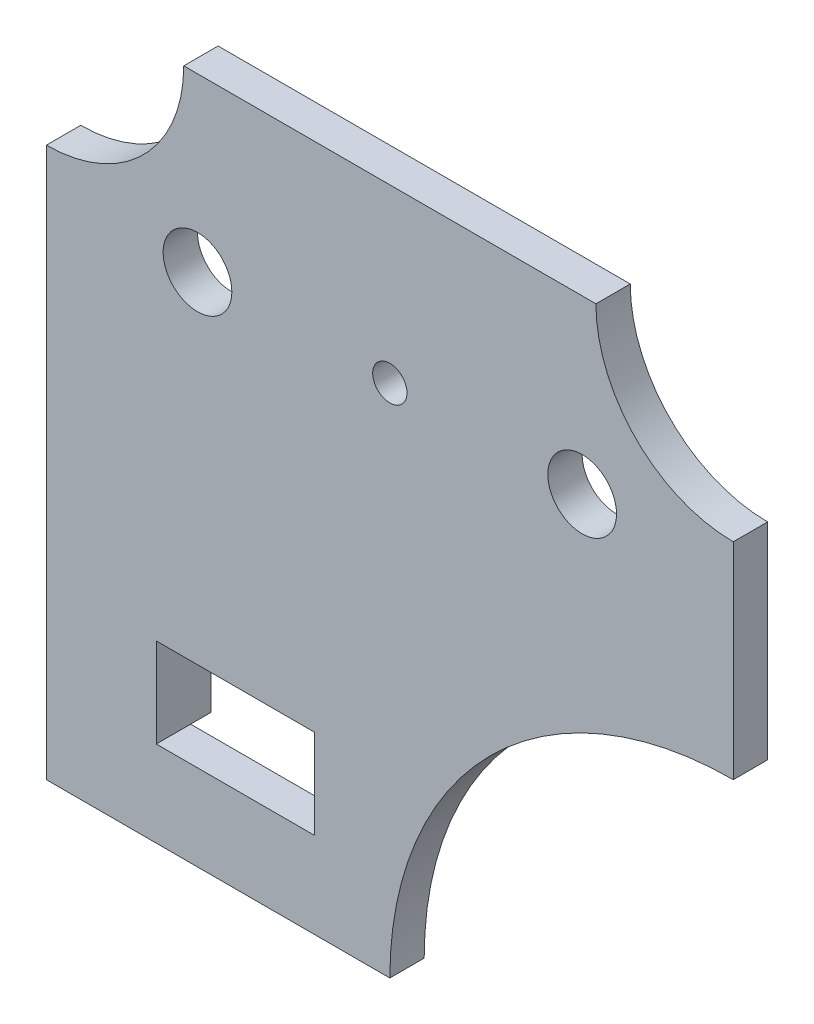
ISO-10303-21;
HEADER;
FILE_DESCRIPTION(('STEP AP214'),'2;1');
FILE_NAME('part.step','',(''),(''),'','','');
FILE_SCHEMA(('AUTOMOTIVE_DESIGN { 1 0 10303 214 1 1 1 1 }'));
ENDSEC;
DATA;
#1=APPLICATION_CONTEXT('core data for automotive mechanical design processes');
#2=APPLICATION_PROTOCOL_DEFINITION('international standard','automotive_design',2000,#1);
#3=PRODUCT_CONTEXT('',#1,'mechanical');
#4=PRODUCT('Part','Part','',(#3));
#5=PRODUCT_RELATED_PRODUCT_CATEGORY('part','',(#4));
#6=PRODUCT_DEFINITION_FORMATION('','',#4);
#7=PRODUCT_DEFINITION_CONTEXT('part definition',#1,'design');
#8=PRODUCT_DEFINITION('design','',#6,#7);
#9=PRODUCT_DEFINITION_SHAPE('','',#8);
#10=(LENGTH_UNIT() NAMED_UNIT(*) SI_UNIT(.MILLI.,.METRE.));
#11=(NAMED_UNIT(*) PLANE_ANGLE_UNIT() SI_UNIT($,.RADIAN.));
#12=(NAMED_UNIT(*) SI_UNIT($,.STERADIAN.) SOLID_ANGLE_UNIT());
#13=UNCERTAINTY_MEASURE_WITH_UNIT(LENGTH_MEASURE(1.E-05),#10,'distance_accuracy_value','');
#14=(GEOMETRIC_REPRESENTATION_CONTEXT(3) GLOBAL_UNCERTAINTY_ASSIGNED_CONTEXT((#13)) GLOBAL_UNIT_ASSIGNED_CONTEXT((#10,
#11,#12)) REPRESENTATION_CONTEXT('',''));
#15=CARTESIAN_POINT('',(0.,0.,0.));
#16=DIRECTION('',(0.,0.,1.));
#17=DIRECTION('',(1.,0.,0.));
#18=AXIS2_PLACEMENT_3D('',#15,#16,#17);
#19=CARTESIAN_POINT('',(50.,-75.,-2.5));
#20=DIRECTION('',(0.,0.,1.));
#21=DIRECTION('',(1.,0.,0.));
#22=AXIS2_PLACEMENT_3D('',#19,#20,#21);
#23=PLANE('',#22);
#24=DIRECTION('',(0.,-1.,0.));
#25=VECTOR('',#24,1.);
#26=CARTESIAN_POINT('',(-50.,5.,-2.5));
#27=LINE('',#26,#25);
#28=CARTESIAN_POINT('',(-50.,5.,-2.5));
#29=VERTEX_POINT('',#28);
#30=CARTESIAN_POINT('',(-50.,-75.,-2.5));
#31=VERTEX_POINT('',#30);
#32=EDGE_CURVE('E298',#29,#31,#27,.T.);
#33=ORIENTED_EDGE('',*,*,#32,.F.);
#34=CARTESIAN_POINT('',(-50.,25.,-2.5));
#35=DIRECTION('',(0.,0.,-1.));
#36=DIRECTION('',(1.,0.,0.));
#37=AXIS2_PLACEMENT_3D('',#34,#35,#36);
#38=CIRCLE('',#37,20.);
#39=CARTESIAN_POINT('',(-30.,25.,-2.5));
#40=VERTEX_POINT('',#39);
#41=EDGE_CURVE('E307',#40,#29,#38,.T.);
#42=ORIENTED_EDGE('',*,*,#41,.F.);
#43=DIRECTION('',(-1.,0.,0.));
#44=VECTOR('',#43,1.);
#45=CARTESIAN_POINT('',(30.,25.,-2.5));
#46=LINE('',#45,#44);
#47=CARTESIAN_POINT('',(30.,25.,-2.5));
#48=VERTEX_POINT('',#47);
#49=EDGE_CURVE('E341',#48,#40,#46,.T.);
#50=ORIENTED_EDGE('',*,*,#49,.F.);
#51=CARTESIAN_POINT('',(50.,25.,-2.5));
#52=DIRECTION('',(0.,0.,-1.));
#53=DIRECTION('',(1.,0.,0.));
#54=AXIS2_PLACEMENT_3D('',#51,#52,#53);
#55=CIRCLE('',#54,20.);
#56=CARTESIAN_POINT('',(50.,5.00000000000001,-2.5));
#57=VERTEX_POINT('',#56);
#58=EDGE_CURVE('E338',#57,#48,#55,.T.);
#59=ORIENTED_EDGE('',*,*,#58,.F.);
#60=DIRECTION('',(0.,1.,0.));
#61=VECTOR('',#60,1.);
#62=CARTESIAN_POINT('',(50.,5.00000000000001,-2.5));
#63=LINE('',#62,#61);
#64=CARTESIAN_POINT('',(50.,-25.,-2.5));
#65=VERTEX_POINT('',#64);
#66=EDGE_CURVE('E335',#65,#57,#63,.T.);
#67=ORIENTED_EDGE('',*,*,#66,.F.);
#68=CARTESIAN_POINT('',(50.,-75.,-2.5));
#69=DIRECTION('',(0.,0.,-1.));
#70=DIRECTION('',(1.,0.,0.));
#71=AXIS2_PLACEMENT_3D('',#68,#69,#70);
#72=CIRCLE('',#71,50.);
#73=CARTESIAN_POINT('',(0.,-75.,-2.5));
#74=VERTEX_POINT('',#73);
#75=EDGE_CURVE('E332',#74,#65,#72,.T.);
#76=ORIENTED_EDGE('',*,*,#75,.F.);
#77=DIRECTION('',(1.,0.,0.));
#78=VECTOR('',#77,1.);
#79=CARTESIAN_POINT('',(0.,-75.,-2.5));
#80=LINE('',#79,#78);
#81=EDGE_CURVE('E329',#31,#74,#80,.T.);
#82=ORIENTED_EDGE('',*,*,#81,.F.);
#83=EDGE_LOOP('',(#33,#42,#50,#59,#67,#76,#82));
#84=FACE_BOUND('',#83,.T.);
#85=CARTESIAN_POINT('',(0.,0.,-2.5));
#86=DIRECTION('',(0.,0.,1.));
#87=DIRECTION('',(1.,0.,0.));
#88=AXIS2_PLACEMENT_3D('',#85,#86,#87);
#89=CIRCLE('',#88,2.5);
#90=CARTESIAN_POINT('',(2.5,0.,-2.5));
#91=VERTEX_POINT('',#90);
#92=EDGE_CURVE('E290',#91,#91,#89,.T.);
#93=ORIENTED_EDGE('',*,*,#92,.T.);
#94=EDGE_LOOP('',(#93));
#95=FACE_BOUND('',#94,.T.);
#96=CARTESIAN_POINT('',(-28.,0.,-2.5));
#97=DIRECTION('',(0.,0.,1.));
#98=DIRECTION('',(1.,0.,0.));
#99=AXIS2_PLACEMENT_3D('',#96,#97,#98);
#100=CIRCLE('',#99,5.);
#101=CARTESIAN_POINT('',(-23.,0.,-2.5));
#102=VERTEX_POINT('',#101);
#103=EDGE_CURVE('E282',#102,#102,#100,.T.);
#104=ORIENTED_EDGE('',*,*,#103,.T.);
#105=EDGE_LOOP('',(#104));
#106=FACE_BOUND('',#105,.T.);
#107=CARTESIAN_POINT('',(28.,0.,-2.5));
#108=DIRECTION('',(0.,0.,1.));
#109=DIRECTION('',(1.,0.,0.));
#110=AXIS2_PLACEMENT_3D('',#107,#108,#109);
#111=CIRCLE('',#110,5.);
#112=CARTESIAN_POINT('',(33.,0.,-2.5));
#113=VERTEX_POINT('',#112);
#114=EDGE_CURVE('E277',#113,#113,#111,.T.);
#115=ORIENTED_EDGE('',*,*,#114,.T.);
#116=EDGE_LOOP('',(#115));
#117=FACE_BOUND('',#116,.T.);
#118=DIRECTION('',(-1.,0.,0.));
#119=VECTOR('',#118,1.);
#120=CARTESIAN_POINT('',(50.,-62.5,-2.5));
#121=LINE('',#120,#119);
#122=CARTESIAN_POINT('',(-6.5,-62.5,-2.5));
#123=VERTEX_POINT('',#122);
#124=CARTESIAN_POINT('',(-11.,-62.5,-2.5));
#125=VERTEX_POINT('',#124);
#126=EDGE_CURVE('E204',#123,#125,#121,.T.);
#127=ORIENTED_EDGE('',*,*,#126,.F.);
#128=DIRECTION('',(0.,-1.,0.));
#129=VECTOR('',#128,1.);
#130=CARTESIAN_POINT('',(-6.5,-75.,-2.5));
#131=LINE('',#130,#129);
#132=CARTESIAN_POINT('',(-6.5,-49.5,-2.5));
#133=VERTEX_POINT('',#132);
#134=EDGE_CURVE('E11',#133,#123,#131,.T.);
#135=ORIENTED_EDGE('',*,*,#134,.F.);
#136=DIRECTION('',(-1.,0.,0.));
#137=VECTOR('',#136,1.);
#138=CARTESIAN_POINT('',(50.,-49.5,-2.5));
#139=LINE('',#138,#137);
#140=CARTESIAN_POINT('',(-11.,-49.5,-2.5));
#141=VERTEX_POINT('',#140);
#142=EDGE_CURVE('E195',#133,#141,#139,.T.);
#143=ORIENTED_EDGE('',*,*,#142,.T.);
#144=DIRECTION('',(-1.,0.,0.));
#145=VECTOR('',#144,1.);
#146=CARTESIAN_POINT('',(-34.,-49.5,-2.5));
#147=LINE('',#146,#145);
#148=CARTESIAN_POINT('',(-34.,-49.5,-2.5));
#149=VERTEX_POINT('',#148);
#150=EDGE_CURVE('E241',#141,#149,#147,.T.);
#151=ORIENTED_EDGE('',*,*,#150,.T.);
#152=DIRECTION('',(-1.,0.,0.));
#153=VECTOR('',#152,1.);
#154=CARTESIAN_POINT('',(50.,-49.5,-2.5));
#155=LINE('',#154,#153);
#156=CARTESIAN_POINT('',(-38.5,-49.5,-2.5));
#157=VERTEX_POINT('',#156);
#158=EDGE_CURVE('E237',#149,#157,#155,.T.);
#159=ORIENTED_EDGE('',*,*,#158,.T.);
#160=DIRECTION('',(0.,-1.,0.));
#161=VECTOR('',#160,1.);
#162=CARTESIAN_POINT('',(-38.5,-75.,-2.5));
#163=LINE('',#162,#161);
#164=CARTESIAN_POINT('',(-38.5,-62.5,-2.5));
#165=VERTEX_POINT('',#164);
#166=EDGE_CURVE('E50',#157,#165,#163,.T.);
#167=ORIENTED_EDGE('',*,*,#166,.T.);
#168=DIRECTION('',(-1.,0.,0.));
#169=VECTOR('',#168,1.);
#170=CARTESIAN_POINT('',(50.,-62.5,-2.5));
#171=LINE('',#170,#169);
#172=CARTESIAN_POINT('',(-34.,-62.5,-2.5));
#173=VERTEX_POINT('',#172);
#174=EDGE_CURVE('E226',#173,#165,#171,.T.);
#175=ORIENTED_EDGE('',*,*,#174,.F.);
#176=DIRECTION('',(1.,0.,0.));
#177=VECTOR('',#176,1.);
#178=CARTESIAN_POINT('',(-34.,-62.5,-2.5));
#179=LINE('',#178,#177);
#180=EDGE_CURVE('E246',#173,#125,#179,.T.);
#181=ORIENTED_EDGE('',*,*,#180,.T.);
#182=EDGE_LOOP('',(#127,#135,#143,#151,#159,#167,#175,#181));
#183=FACE_BOUND('',#182,.T.);
#184=ADVANCED_FACE('F41',(#84,#95,#106,#117,#183),#23,.F.);
#185=CARTESIAN_POINT('',(50.,-75.,2.5));
#186=DIRECTION('',(0.,0.,1.));
#187=DIRECTION('',(1.,0.,0.));
#188=AXIS2_PLACEMENT_3D('',#185,#186,#187);
#189=PLANE('',#188);
#190=DIRECTION('',(0.,1.,0.));
#191=VECTOR('',#190,1.);
#192=CARTESIAN_POINT('',(-11.,-62.5,2.5));
#193=LINE('',#192,#191);
#194=CARTESIAN_POINT('',(-11.,-62.5,2.5));
#195=VERTEX_POINT('',#194);
#196=CARTESIAN_POINT('',(-11.,-49.5,2.5));
#197=VERTEX_POINT('',#196);
#198=EDGE_CURVE('E242',#195,#197,#193,.T.);
#199=ORIENTED_EDGE('',*,*,#198,.F.);
#200=DIRECTION('',(1.,0.,0.));
#201=VECTOR('',#200,1.);
#202=CARTESIAN_POINT('',(-34.,-62.5,2.5));
#203=LINE('',#202,#201);
#204=CARTESIAN_POINT('',(-34.,-62.5,2.5));
#205=VERTEX_POINT('',#204);
#206=EDGE_CURVE('E253',#205,#195,#203,.T.);
#207=ORIENTED_EDGE('',*,*,#206,.F.);
#208=DIRECTION('',(0.,-1.,0.));
#209=VECTOR('',#208,1.);
#210=CARTESIAN_POINT('',(-34.,-62.5,2.5));
#211=LINE('',#210,#209);
#212=CARTESIAN_POINT('',(-34.,-49.5,2.5));
#213=VERTEX_POINT('',#212);
#214=EDGE_CURVE('E249',#213,#205,#211,.T.);
#215=ORIENTED_EDGE('',*,*,#214,.F.);
#216=DIRECTION('',(-1.,0.,0.));
#217=VECTOR('',#216,1.);
#218=CARTESIAN_POINT('',(-34.,-49.5,2.5));
#219=LINE('',#218,#217);
#220=EDGE_CURVE('E245',#197,#213,#219,.T.);
#221=ORIENTED_EDGE('',*,*,#220,.F.);
#222=EDGE_LOOP('',(#199,#207,#215,#221));
#223=FACE_BOUND('',#222,.T.);
#224=CARTESIAN_POINT('',(-28.,0.,2.5));
#225=DIRECTION('',(0.,0.,1.));
#226=DIRECTION('',(1.,0.,0.));
#227=AXIS2_PLACEMENT_3D('',#224,#225,#226);
#228=CIRCLE('',#227,5.);
#229=CARTESIAN_POINT('',(-23.,0.,2.5));
#230=VERTEX_POINT('',#229);
#231=EDGE_CURVE('E286',#230,#230,#228,.T.);
#232=ORIENTED_EDGE('',*,*,#231,.F.);
#233=EDGE_LOOP('',(#232));
#234=FACE_BOUND('',#233,.T.);
#235=DIRECTION('',(0.,-1.,0.));
#236=VECTOR('',#235,1.);
#237=CARTESIAN_POINT('',(-50.,5.,2.5));
#238=LINE('',#237,#236);
#239=CARTESIAN_POINT('',(-50.,5.,2.5));
#240=VERTEX_POINT('',#239);
#241=CARTESIAN_POINT('',(-50.,-75.,2.5));
#242=VERTEX_POINT('',#241);
#243=EDGE_CURVE('E302',#240,#242,#238,.T.);
#244=ORIENTED_EDGE('',*,*,#243,.T.);
#245=DIRECTION('',(1.,0.,0.));
#246=VECTOR('',#245,1.);
#247=CARTESIAN_POINT('',(0.,-75.,2.5));
#248=LINE('',#247,#246);
#249=CARTESIAN_POINT('',(0.,-75.,2.5));
#250=VERTEX_POINT('',#249);
#251=EDGE_CURVE('E306',#242,#250,#248,.T.);
#252=ORIENTED_EDGE('',*,*,#251,.T.);
#253=CARTESIAN_POINT('',(50.,-75.,2.5));
#254=DIRECTION('',(0.,0.,-1.));
#255=DIRECTION('',(1.,0.,0.));
#256=AXIS2_PLACEMENT_3D('',#253,#254,#255);
#257=CIRCLE('',#256,50.);
#258=CARTESIAN_POINT('',(50.,-25.,2.5));
#259=VERTEX_POINT('',#258);
#260=EDGE_CURVE('E310',#250,#259,#257,.T.);
#261=ORIENTED_EDGE('',*,*,#260,.T.);
#262=DIRECTION('',(0.,1.,0.));
#263=VECTOR('',#262,1.);
#264=CARTESIAN_POINT('',(50.,5.00000000000001,2.5));
#265=LINE('',#264,#263);
#266=CARTESIAN_POINT('',(50.,5.00000000000001,2.5));
#267=VERTEX_POINT('',#266);
#268=EDGE_CURVE('E313',#259,#267,#265,.T.);
#269=ORIENTED_EDGE('',*,*,#268,.T.);
#270=CARTESIAN_POINT('',(50.,25.,2.5));
#271=DIRECTION('',(0.,0.,-1.));
#272=DIRECTION('',(1.,0.,0.));
#273=AXIS2_PLACEMENT_3D('',#270,#271,#272);
#274=CIRCLE('',#273,20.);
#275=CARTESIAN_POINT('',(30.,25.,2.5));
#276=VERTEX_POINT('',#275);
#277=EDGE_CURVE('E316',#267,#276,#274,.T.);
#278=ORIENTED_EDGE('',*,*,#277,.T.);
#279=DIRECTION('',(-1.,0.,0.));
#280=VECTOR('',#279,1.);
#281=CARTESIAN_POINT('',(30.,25.,2.5));
#282=LINE('',#281,#280);
#283=CARTESIAN_POINT('',(-30.,25.,2.5));
#284=VERTEX_POINT('',#283);
#285=EDGE_CURVE('E319',#276,#284,#282,.T.);
#286=ORIENTED_EDGE('',*,*,#285,.T.);
#287=CARTESIAN_POINT('',(-50.,25.,2.5));
#288=DIRECTION('',(0.,0.,-1.));
#289=DIRECTION('',(1.,0.,0.));
#290=AXIS2_PLACEMENT_3D('',#287,#288,#289);
#291=CIRCLE('',#290,20.);
#292=EDGE_CURVE('E322',#284,#240,#291,.T.);
#293=ORIENTED_EDGE('',*,*,#292,.T.);
#294=EDGE_LOOP('',(#244,#252,#261,#269,#278,#286,#293));
#295=FACE_BOUND('',#294,.T.);
#296=CARTESIAN_POINT('',(0.,0.,2.5));
#297=DIRECTION('',(0.,0.,1.));
#298=DIRECTION('',(1.,0.,0.));
#299=AXIS2_PLACEMENT_3D('',#296,#297,#298);
#300=CIRCLE('',#299,2.5);
#301=CARTESIAN_POINT('',(2.5,0.,2.5));
#302=VERTEX_POINT('',#301);
#303=EDGE_CURVE('E294',#302,#302,#300,.T.);
#304=ORIENTED_EDGE('',*,*,#303,.F.);
#305=EDGE_LOOP('',(#304));
#306=FACE_BOUND('',#305,.T.);
#307=CARTESIAN_POINT('',(28.,0.,2.5));
#308=DIRECTION('',(0.,0.,1.));
#309=DIRECTION('',(1.,0.,0.));
#310=AXIS2_PLACEMENT_3D('',#307,#308,#309);
#311=CIRCLE('',#310,5.);
#312=CARTESIAN_POINT('',(33.,0.,2.5));
#313=VERTEX_POINT('',#312);
#314=EDGE_CURVE('E278',#313,#313,#311,.T.);
#315=ORIENTED_EDGE('',*,*,#314,.F.);
#316=EDGE_LOOP('',(#315));
#317=FACE_BOUND('',#316,.T.);
#318=ADVANCED_FACE('F400',(#223,#234,#295,#306,#317),#189,.T.);
#319=CARTESIAN_POINT('',(-50.,5.,2.5));
#320=DIRECTION('',(1.,0.,0.));
#321=DIRECTION('',(0.,1.,0.));
#322=AXIS2_PLACEMENT_3D('',#319,#320,#321);
#323=PLANE('',#322);
#324=ORIENTED_EDGE('',*,*,#32,.T.);
#325=DIRECTION('',(0.,0.,-1.));
#326=VECTOR('',#325,1.);
#327=CARTESIAN_POINT('',(-50.,-75.,2.5));
#328=LINE('',#327,#326);
#329=EDGE_CURVE('E369',#242,#31,#328,.T.);
#330=ORIENTED_EDGE('',*,*,#329,.F.);
#331=ORIENTED_EDGE('',*,*,#243,.F.);
#332=DIRECTION('',(0.,0.,-1.));
#333=VECTOR('',#332,1.);
#334=CARTESIAN_POINT('',(-50.,5.,2.5));
#335=LINE('',#334,#333);
#336=EDGE_CURVE('E325',#240,#29,#335,.T.);
#337=ORIENTED_EDGE('',*,*,#336,.T.);
#338=EDGE_LOOP('',(#324,#330,#331,#337));
#339=FACE_BOUND('',#338,.T.);
#340=ADVANCED_FACE('F43',(#339),#323,.F.);
#341=CARTESIAN_POINT('',(0.,-75.,2.5));
#342=DIRECTION('',(0.,1.,0.));
#343=DIRECTION('',(-1.,0.,0.));
#344=AXIS2_PLACEMENT_3D('',#341,#342,#343);
#345=PLANE('',#344);
#346=ORIENTED_EDGE('',*,*,#81,.T.);
#347=DIRECTION('',(0.,0.,-1.));
#348=VECTOR('',#347,1.);
#349=CARTESIAN_POINT('',(0.,-75.,2.5));
#350=LINE('',#349,#348);
#351=EDGE_CURVE('E365',#250,#74,#350,.T.);
#352=ORIENTED_EDGE('',*,*,#351,.F.);
#353=ORIENTED_EDGE('',*,*,#251,.F.);
#354=ORIENTED_EDGE('',*,*,#329,.T.);
#355=EDGE_LOOP('',(#346,#352,#353,#354));
#356=FACE_BOUND('',#355,.T.);
#357=ADVANCED_FACE('F431',(#356),#345,.F.);
#358=CARTESIAN_POINT('',(50.,-75.,2.5));
#359=DIRECTION('',(0.,0.,-1.));
#360=DIRECTION('',(-1.,0.,0.));
#361=AXIS2_PLACEMENT_3D('',#358,#359,#360);
#362=CYLINDRICAL_SURFACE('',#361,50.);
#363=ORIENTED_EDGE('',*,*,#75,.T.);
#364=DIRECTION('',(0.,0.,-1.));
#365=VECTOR('',#364,1.);
#366=CARTESIAN_POINT('',(50.,-25.,2.5));
#367=LINE('',#366,#365);
#368=EDGE_CURVE('E361',#259,#65,#367,.T.);
#369=ORIENTED_EDGE('',*,*,#368,.F.);
#370=ORIENTED_EDGE('',*,*,#260,.F.);
#371=ORIENTED_EDGE('',*,*,#351,.T.);
#372=EDGE_LOOP('',(#363,#369,#370,#371));
#373=FACE_BOUND('',#372,.T.);
#374=ADVANCED_FACE('F428',(#373),#362,.F.);
#375=CARTESIAN_POINT('',(50.,5.00000000000001,2.5));
#376=DIRECTION('',(-1.,0.,0.));
#377=DIRECTION('',(0.,0.,1.));
#378=AXIS2_PLACEMENT_3D('',#375,#376,#377);
#379=PLANE('',#378);
#380=ORIENTED_EDGE('',*,*,#66,.T.);
#381=DIRECTION('',(0.,0.,-1.));
#382=VECTOR('',#381,1.);
#383=CARTESIAN_POINT('',(50.,5.00000000000001,2.5));
#384=LINE('',#383,#382);
#385=EDGE_CURVE('E357',#267,#57,#384,.T.);
#386=ORIENTED_EDGE('',*,*,#385,.F.);
#387=ORIENTED_EDGE('',*,*,#268,.F.);
#388=ORIENTED_EDGE('',*,*,#368,.T.);
#389=EDGE_LOOP('',(#380,#386,#387,#388));
#390=FACE_BOUND('',#389,.T.);
#391=ADVANCED_FACE('F424',(#390),#379,.F.);
#392=CARTESIAN_POINT('',(50.,25.,2.5));
#393=DIRECTION('',(0.,0.,-1.));
#394=DIRECTION('',(-1.,0.,0.));
#395=AXIS2_PLACEMENT_3D('',#392,#393,#394);
#396=CYLINDRICAL_SURFACE('',#395,20.);
#397=ORIENTED_EDGE('',*,*,#58,.T.);
#398=DIRECTION('',(0.,0.,-1.));
#399=VECTOR('',#398,1.);
#400=CARTESIAN_POINT('',(30.,25.,2.5));
#401=LINE('',#400,#399);
#402=EDGE_CURVE('E353',#276,#48,#401,.T.);
#403=ORIENTED_EDGE('',*,*,#402,.F.);
#404=ORIENTED_EDGE('',*,*,#277,.F.);
#405=ORIENTED_EDGE('',*,*,#385,.T.);
#406=EDGE_LOOP('',(#397,#403,#404,#405));
#407=FACE_BOUND('',#406,.T.);
#408=ADVANCED_FACE('F420',(#407),#396,.F.);
#409=CARTESIAN_POINT('',(30.,25.,2.5));
#410=DIRECTION('',(0.,-1.,0.));
#411=DIRECTION('',(1.,0.,0.));
#412=AXIS2_PLACEMENT_3D('',#409,#410,#411);
#413=PLANE('',#412);
#414=ORIENTED_EDGE('',*,*,#49,.T.);
#415=DIRECTION('',(0.,0.,-1.));
#416=VECTOR('',#415,1.);
#417=CARTESIAN_POINT('',(-30.,25.,2.5));
#418=LINE('',#417,#416);
#419=EDGE_CURVE('E349',#284,#40,#418,.T.);
#420=ORIENTED_EDGE('',*,*,#419,.F.);
#421=ORIENTED_EDGE('',*,*,#285,.F.);
#422=ORIENTED_EDGE('',*,*,#402,.T.);
#423=EDGE_LOOP('',(#414,#420,#421,#422));
#424=FACE_BOUND('',#423,.T.);
#425=ADVANCED_FACE('F416',(#424),#413,.F.);
#426=CARTESIAN_POINT('',(-50.,25.,2.5));
#427=DIRECTION('',(0.,0.,-1.));
#428=DIRECTION('',(-1.,0.,0.));
#429=AXIS2_PLACEMENT_3D('',#426,#427,#428);
#430=CYLINDRICAL_SURFACE('',#429,20.);
#431=ORIENTED_EDGE('',*,*,#41,.T.);
#432=ORIENTED_EDGE('',*,*,#336,.F.);
#433=ORIENTED_EDGE('',*,*,#292,.F.);
#434=ORIENTED_EDGE('',*,*,#419,.T.);
#435=EDGE_LOOP('',(#431,#432,#433,#434));
#436=FACE_BOUND('',#435,.T.);
#437=ADVANCED_FACE('F412',(#436),#430,.F.);
#438=CARTESIAN_POINT('',(0.,0.,2.5));
#439=DIRECTION('',(0.,0.,-1.));
#440=DIRECTION('',(-1.,0.,0.));
#441=AXIS2_PLACEMENT_3D('',#438,#439,#440);
#442=CYLINDRICAL_SURFACE('',#441,2.5);
#443=ORIENTED_EDGE('',*,*,#303,.T.);
#444=EDGE_LOOP('',(#443));
#445=FACE_BOUND('',#444,.T.);
#446=ORIENTED_EDGE('',*,*,#92,.F.);
#447=EDGE_LOOP('',(#446));
#448=FACE_BOUND('',#447,.T.);
#449=ADVANCED_FACE('F415',(#445,#448),#442,.F.);
#450=CARTESIAN_POINT('',(-28.,0.,2.5));
#451=DIRECTION('',(0.,0.,-1.));
#452=DIRECTION('',(-1.,0.,0.));
#453=AXIS2_PLACEMENT_3D('',#450,#451,#452);
#454=CYLINDRICAL_SURFACE('',#453,5.);
#455=ORIENTED_EDGE('',*,*,#231,.T.);
#456=EDGE_LOOP('',(#455));
#457=FACE_BOUND('',#456,.T.);
#458=ORIENTED_EDGE('',*,*,#103,.F.);
#459=EDGE_LOOP('',(#458));
#460=FACE_BOUND('',#459,.T.);
#461=ADVANCED_FACE('F467',(#457,#460),#454,.F.);
#462=CARTESIAN_POINT('',(28.,0.,2.5));
#463=DIRECTION('',(0.,0.,-1.));
#464=DIRECTION('',(-1.,0.,0.));
#465=AXIS2_PLACEMENT_3D('',#462,#463,#464);
#466=CYLINDRICAL_SURFACE('',#465,5.);
#467=ORIENTED_EDGE('',*,*,#314,.T.);
#468=EDGE_LOOP('',(#467));
#469=FACE_BOUND('',#468,.T.);
#470=ORIENTED_EDGE('',*,*,#114,.F.);
#471=EDGE_LOOP('',(#470));
#472=FACE_BOUND('',#471,.T.);
#473=ADVANCED_FACE('F463',(#469,#472),#466,.F.);
#474=CARTESIAN_POINT('',(-11.,-62.5,2.5));
#475=DIRECTION('',(-1.,0.,0.));
#476=DIRECTION('',(0.,0.,1.));
#477=AXIS2_PLACEMENT_3D('',#474,#475,#476);
#478=PLANE('',#477);
#479=DIRECTION('',(0.,0.,-1.));
#480=VECTOR('',#479,1.);
#481=CARTESIAN_POINT('',(-11.,-49.5,2.5));
#482=LINE('',#481,#480);
#483=EDGE_CURVE('E273',#197,#141,#482,.T.);
#484=ORIENTED_EDGE('',*,*,#483,.T.);
#485=DIRECTION('',(0.,0.,1.));
#486=VECTOR('',#485,1.);
#487=CARTESIAN_POINT('',(-11.,-49.5,-5.5));
#488=LINE('',#487,#486);
#489=CARTESIAN_POINT('',(-11.,-49.5,-5.5));
#490=VERTEX_POINT('',#489);
#491=EDGE_CURVE('E196',#490,#141,#488,.T.);
#492=ORIENTED_EDGE('',*,*,#491,.F.);
#493=DIRECTION('',(0.,-1.,0.));
#494=VECTOR('',#493,1.);
#495=CARTESIAN_POINT('',(-11.,0.,-5.5));
#496=LINE('',#495,#494);
#497=CARTESIAN_POINT('',(-11.,-62.5,-5.5));
#498=VERTEX_POINT('',#497);
#499=EDGE_CURVE('E180',#490,#498,#496,.T.);
#500=ORIENTED_EDGE('',*,*,#499,.T.);
#501=DIRECTION('',(0.,0.,1.));
#502=VECTOR('',#501,1.);
#503=CARTESIAN_POINT('',(-11.,-62.5,-5.5));
#504=LINE('',#503,#502);
#505=EDGE_CURVE('E184',#498,#125,#504,.T.);
#506=ORIENTED_EDGE('',*,*,#505,.T.);
#507=DIRECTION('',(0.,0.,-1.));
#508=VECTOR('',#507,1.);
#509=CARTESIAN_POINT('',(-11.,-62.5,2.5));
#510=LINE('',#509,#508);
#511=EDGE_CURVE('E256',#195,#125,#510,.T.);
#512=ORIENTED_EDGE('',*,*,#511,.F.);
#513=ORIENTED_EDGE('',*,*,#198,.T.);
#514=EDGE_LOOP('',(#484,#492,#500,#506,#512,#513));
#515=FACE_BOUND('',#514,.T.);
#516=ADVANCED_FACE('F466',(#515),#478,.T.);
#517=CARTESIAN_POINT('',(-34.,-49.5,2.5));
#518=DIRECTION('',(0.,-1.,0.));
#519=DIRECTION('',(0.,0.,-1.));
#520=AXIS2_PLACEMENT_3D('',#517,#518,#519);
#521=PLANE('',#520);
#522=ORIENTED_EDGE('',*,*,#150,.F.);
#523=ORIENTED_EDGE('',*,*,#483,.F.);
#524=ORIENTED_EDGE('',*,*,#220,.T.);
#525=DIRECTION('',(0.,0.,-1.));
#526=VECTOR('',#525,1.);
#527=CARTESIAN_POINT('',(-34.,-49.5,2.5));
#528=LINE('',#527,#526);
#529=EDGE_CURVE('E269',#213,#149,#528,.T.);
#530=ORIENTED_EDGE('',*,*,#529,.T.);
#531=EDGE_LOOP('',(#522,#523,#524,#530));
#532=FACE_BOUND('',#531,.T.);
#533=ADVANCED_FACE('F475',(#532),#521,.T.);
#534=CARTESIAN_POINT('',(-34.,-62.5,2.5));
#535=DIRECTION('',(1.,0.,0.));
#536=DIRECTION('',(0.,0.,-1.));
#537=AXIS2_PLACEMENT_3D('',#534,#535,#536);
#538=PLANE('',#537);
#539=DIRECTION('',(0.,0.,-1.));
#540=VECTOR('',#539,1.);
#541=CARTESIAN_POINT('',(-34.,-62.5,2.5));
#542=LINE('',#541,#540);
#543=EDGE_CURVE('E265',#205,#173,#542,.T.);
#544=ORIENTED_EDGE('',*,*,#543,.T.);
#545=DIRECTION('',(0.,0.,1.));
#546=VECTOR('',#545,1.);
#547=CARTESIAN_POINT('',(-34.,-62.5,-5.5));
#548=LINE('',#547,#546);
#549=CARTESIAN_POINT('',(-34.,-62.5,-5.5));
#550=VERTEX_POINT('',#549);
#551=EDGE_CURVE('E227',#550,#173,#548,.T.);
#552=ORIENTED_EDGE('',*,*,#551,.F.);
#553=DIRECTION('',(0.,1.,0.));
#554=VECTOR('',#553,1.);
#555=CARTESIAN_POINT('',(-34.,0.,-5.5));
#556=LINE('',#555,#554);
#557=CARTESIAN_POINT('',(-34.,-49.5,-5.5));
#558=VERTEX_POINT('',#557);
#559=EDGE_CURVE('E217',#550,#558,#556,.T.);
#560=ORIENTED_EDGE('',*,*,#559,.T.);
#561=DIRECTION('',(0.,0.,1.));
#562=VECTOR('',#561,1.);
#563=CARTESIAN_POINT('',(-34.,-49.5,-5.5));
#564=LINE('',#563,#562);
#565=EDGE_CURVE('E222',#558,#149,#564,.T.);
#566=ORIENTED_EDGE('',*,*,#565,.T.);
#567=ORIENTED_EDGE('',*,*,#529,.F.);
#568=ORIENTED_EDGE('',*,*,#214,.T.);
#569=EDGE_LOOP('',(#544,#552,#560,#566,#567,#568));
#570=FACE_BOUND('',#569,.T.);
#571=ADVANCED_FACE('F384',(#570),#538,.T.);
#572=CARTESIAN_POINT('',(-34.,-62.5,2.5));
#573=DIRECTION('',(0.,1.,0.));
#574=DIRECTION('',(0.,0.,1.));
#575=AXIS2_PLACEMENT_3D('',#572,#573,#574);
#576=PLANE('',#575);
#577=ORIENTED_EDGE('',*,*,#180,.F.);
#578=ORIENTED_EDGE('',*,*,#543,.F.);
#579=ORIENTED_EDGE('',*,*,#206,.T.);
#580=ORIENTED_EDGE('',*,*,#511,.T.);
#581=EDGE_LOOP('',(#577,#578,#579,#580));
#582=FACE_BOUND('',#581,.T.);
#583=ADVANCED_FACE('F539',(#582),#576,.T.);
#584=CARTESIAN_POINT('',(-38.5,0.,-5.5));
#585=DIRECTION('',(-1.,0.,0.));
#586=DIRECTION('',(0.,0.,1.));
#587=AXIS2_PLACEMENT_3D('',#584,#585,#586);
#588=PLANE('',#587);
#589=ORIENTED_EDGE('',*,*,#166,.F.);
#590=DIRECTION('',(0.,0.,1.));
#591=VECTOR('',#590,1.);
#592=CARTESIAN_POINT('',(-38.5,-49.5,-5.5));
#593=LINE('',#592,#591);
#594=CARTESIAN_POINT('',(-38.5,-49.5,-5.5));
#595=VERTEX_POINT('',#594);
#596=EDGE_CURVE('E221',#595,#157,#593,.T.);
#597=ORIENTED_EDGE('',*,*,#596,.F.);
#598=DIRECTION('',(0.,-1.,0.));
#599=VECTOR('',#598,1.);
#600=CARTESIAN_POINT('',(-38.5,0.,-5.5));
#601=LINE('',#600,#599);
#602=CARTESIAN_POINT('',(-38.5,-62.5,-5.5));
#603=VERTEX_POINT('',#602);
#604=EDGE_CURVE('E211',#595,#603,#601,.T.);
#605=ORIENTED_EDGE('',*,*,#604,.T.);
#606=DIRECTION('',(0.,0.,1.));
#607=VECTOR('',#606,1.);
#608=CARTESIAN_POINT('',(-38.5,-62.5,-5.5));
#609=LINE('',#608,#607);
#610=EDGE_CURVE('E63',#603,#165,#609,.T.);
#611=ORIENTED_EDGE('',*,*,#610,.T.);
#612=EDGE_LOOP('',(#589,#597,#605,#611));
#613=FACE_BOUND('',#612,.T.);
#614=ADVANCED_FACE('F375',(#613),#588,.T.);
#615=CARTESIAN_POINT('',(0.,-49.5,-5.5));
#616=DIRECTION('',(0.,1.,0.));
#617=DIRECTION('',(0.,0.,1.));
#618=AXIS2_PLACEMENT_3D('',#615,#616,#617);
#619=PLANE('',#618);
#620=ORIENTED_EDGE('',*,*,#158,.F.);
#621=ORIENTED_EDGE('',*,*,#565,.F.);
#622=DIRECTION('',(-1.,0.,0.));
#623=VECTOR('',#622,1.);
#624=CARTESIAN_POINT('',(0.,-49.5,-5.5));
#625=LINE('',#624,#623);
#626=EDGE_CURVE('E207',#558,#595,#625,.T.);
#627=ORIENTED_EDGE('',*,*,#626,.T.);
#628=ORIENTED_EDGE('',*,*,#596,.T.);
#629=EDGE_LOOP('',(#620,#621,#627,#628));
#630=FACE_BOUND('',#629,.T.);
#631=ADVANCED_FACE('F378',(#630),#619,.T.);
#632=CARTESIAN_POINT('',(0.,-62.5,-5.5));
#633=DIRECTION('',(0.,1.,0.));
#634=DIRECTION('',(0.,0.,1.));
#635=AXIS2_PLACEMENT_3D('',#632,#633,#634);
#636=PLANE('',#635);
#637=ORIENTED_EDGE('',*,*,#551,.T.);
#638=ORIENTED_EDGE('',*,*,#174,.T.);
#639=ORIENTED_EDGE('',*,*,#610,.F.);
#640=DIRECTION('',(-1.,0.,0.));
#641=VECTOR('',#640,1.);
#642=CARTESIAN_POINT('',(0.,-62.5,-5.5));
#643=LINE('',#642,#641);
#644=EDGE_CURVE('E214',#550,#603,#643,.T.);
#645=ORIENTED_EDGE('',*,*,#644,.F.);
#646=EDGE_LOOP('',(#637,#638,#639,#645));
#647=FACE_BOUND('',#646,.T.);
#648=ADVANCED_FACE('F389',(#647),#636,.F.);
#649=CARTESIAN_POINT('',(0.,0.,-5.5));
#650=DIRECTION('',(0.,0.,1.));
#651=DIRECTION('',(1.,0.,0.));
#652=AXIS2_PLACEMENT_3D('',#649,#650,#651);
#653=PLANE('',#652);
#654=ORIENTED_EDGE('',*,*,#626,.F.);
#655=ORIENTED_EDGE('',*,*,#559,.F.);
#656=ORIENTED_EDGE('',*,*,#644,.T.);
#657=ORIENTED_EDGE('',*,*,#604,.F.);
#658=EDGE_LOOP('',(#654,#655,#656,#657));
#659=FACE_BOUND('',#658,.T.);
#660=ADVANCED_FACE('F382',(#659),#653,.F.);
#661=CARTESIAN_POINT('',(-6.5,0.,-5.5));
#662=DIRECTION('',(-1.,0.,0.));
#663=DIRECTION('',(0.,0.,1.));
#664=AXIS2_PLACEMENT_3D('',#661,#662,#663);
#665=PLANE('',#664);
#666=DIRECTION('',(0.,0.,1.));
#667=VECTOR('',#666,1.);
#668=CARTESIAN_POINT('',(-6.5,-49.5,-5.5));
#669=LINE('',#668,#667);
#670=CARTESIAN_POINT('',(-6.5,-49.5,-5.5));
#671=VERTEX_POINT('',#670);
#672=EDGE_CURVE('E179',#671,#133,#669,.T.);
#673=ORIENTED_EDGE('',*,*,#672,.T.);
#674=ORIENTED_EDGE('',*,*,#134,.T.);
#675=DIRECTION('',(0.,0.,1.));
#676=VECTOR('',#675,1.);
#677=CARTESIAN_POINT('',(-6.5,-62.5,-5.5));
#678=LINE('',#677,#676);
#679=CARTESIAN_POINT('',(-6.5,-62.5,-5.5));
#680=VERTEX_POINT('',#679);
#681=EDGE_CURVE('E174',#680,#123,#678,.T.);
#682=ORIENTED_EDGE('',*,*,#681,.F.);
#683=DIRECTION('',(0.,-1.,0.));
#684=VECTOR('',#683,1.);
#685=CARTESIAN_POINT('',(-6.5,0.,-5.5));
#686=LINE('',#685,#684);
#687=EDGE_CURVE('E160',#671,#680,#686,.T.);
#688=ORIENTED_EDGE('',*,*,#687,.F.);
#689=EDGE_LOOP('',(#673,#674,#682,#688));
#690=FACE_BOUND('',#689,.T.);
#691=ADVANCED_FACE('F175',(#690),#665,.F.);
#692=CARTESIAN_POINT('',(0.,-62.5,-5.5));
#693=DIRECTION('',(0.,1.,0.));
#694=DIRECTION('',(0.,0.,1.));
#695=AXIS2_PLACEMENT_3D('',#692,#693,#694);
#696=PLANE('',#695);
#697=ORIENTED_EDGE('',*,*,#681,.T.);
#698=ORIENTED_EDGE('',*,*,#126,.T.);
#699=ORIENTED_EDGE('',*,*,#505,.F.);
#700=DIRECTION('',(-1.,0.,0.));
#701=VECTOR('',#700,1.);
#702=CARTESIAN_POINT('',(0.,-62.5,-5.5));
#703=LINE('',#702,#701);
#704=EDGE_CURVE('E165',#680,#498,#703,.T.);
#705=ORIENTED_EDGE('',*,*,#704,.F.);
#706=EDGE_LOOP('',(#697,#698,#699,#705));
#707=FACE_BOUND('',#706,.T.);
#708=ADVANCED_FACE('F182',(#707),#696,.F.);
#709=CARTESIAN_POINT('',(0.,-49.5,-5.5));
#710=DIRECTION('',(0.,1.,0.));
#711=DIRECTION('',(0.,0.,1.));
#712=AXIS2_PLACEMENT_3D('',#709,#710,#711);
#713=PLANE('',#712);
#714=ORIENTED_EDGE('',*,*,#142,.F.);
#715=ORIENTED_EDGE('',*,*,#672,.F.);
#716=DIRECTION('',(-1.,0.,0.));
#717=VECTOR('',#716,1.);
#718=CARTESIAN_POINT('',(0.,-49.5,-5.5));
#719=LINE('',#718,#717);
#720=EDGE_CURVE('E168',#671,#490,#719,.T.);
#721=ORIENTED_EDGE('',*,*,#720,.T.);
#722=ORIENTED_EDGE('',*,*,#491,.T.);
#723=EDGE_LOOP('',(#714,#715,#721,#722));
#724=FACE_BOUND('',#723,.T.);
#725=ADVANCED_FACE('F587',(#724),#713,.T.);
#726=CARTESIAN_POINT('',(0.,0.,-5.5));
#727=DIRECTION('',(0.,0.,1.));
#728=DIRECTION('',(1.,0.,0.));
#729=AXIS2_PLACEMENT_3D('',#726,#727,#728);
#730=PLANE('',#729);
#731=ORIENTED_EDGE('',*,*,#704,.T.);
#732=ORIENTED_EDGE('',*,*,#499,.F.);
#733=ORIENTED_EDGE('',*,*,#720,.F.);
#734=ORIENTED_EDGE('',*,*,#687,.T.);
#735=EDGE_LOOP('',(#731,#732,#733,#734));
#736=FACE_BOUND('',#735,.T.);
#737=ADVANCED_FACE('F162',(#736),#730,.F.);
#738=CLOSED_SHELL('',(#184,#318,#340,#357,#374,#391,#408,#425,#437,#449,#461,#473,#516,#533,
#571,#583,#614,#631,#648,#660,#691,#708,#725,#737));
#739=MANIFOLD_SOLID_BREP('B2',#738);
#740=ADVANCED_BREP_SHAPE_REPRESENTATION('',(#18,#739),#14);
#741=SHAPE_DEFINITION_REPRESENTATION(#9,#740);
ENDSEC;
END-ISO-10303-21;
